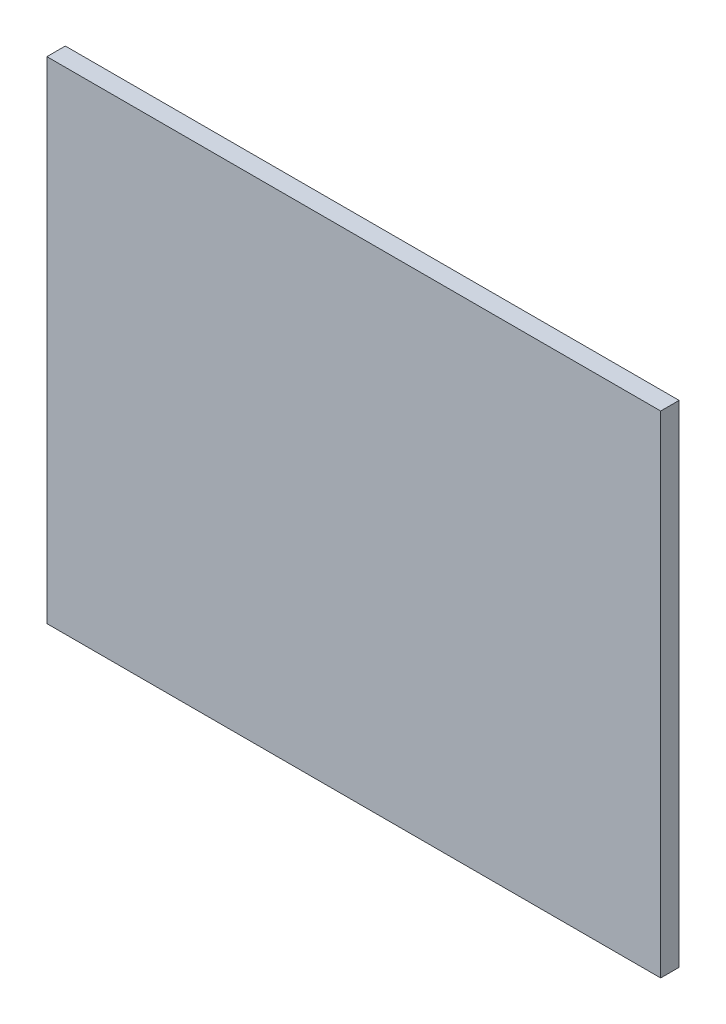
ISO-10303-21;
HEADER;
FILE_DESCRIPTION(('STEP AP214'),'2;1');
FILE_NAME('part.step','',(''),(''),'','','');
FILE_SCHEMA(('AUTOMOTIVE_DESIGN { 1 0 10303 214 1 1 1 1 }'));
ENDSEC;
DATA;
#1=APPLICATION_CONTEXT('core data for automotive mechanical design processes');
#2=APPLICATION_PROTOCOL_DEFINITION('international standard','automotive_design',2000,#1);
#3=PRODUCT_CONTEXT('',#1,'mechanical');
#4=PRODUCT('Part','Part','',(#3));
#5=PRODUCT_RELATED_PRODUCT_CATEGORY('part','',(#4));
#6=PRODUCT_DEFINITION_FORMATION('','',#4);
#7=PRODUCT_DEFINITION_CONTEXT('part definition',#1,'design');
#8=PRODUCT_DEFINITION('design','',#6,#7);
#9=PRODUCT_DEFINITION_SHAPE('','',#8);
#10=(LENGTH_UNIT() NAMED_UNIT(*) SI_UNIT(.MILLI.,.METRE.));
#11=(NAMED_UNIT(*) PLANE_ANGLE_UNIT() SI_UNIT($,.RADIAN.));
#12=(NAMED_UNIT(*) SI_UNIT($,.STERADIAN.) SOLID_ANGLE_UNIT());
#13=UNCERTAINTY_MEASURE_WITH_UNIT(LENGTH_MEASURE(1.E-05),#10,'distance_accuracy_value','');
#14=(GEOMETRIC_REPRESENTATION_CONTEXT(3) GLOBAL_UNCERTAINTY_ASSIGNED_CONTEXT((#13)) GLOBAL_UNIT_ASSIGNED_CONTEXT((#10,
#11,#12)) REPRESENTATION_CONTEXT('',''));
#15=CARTESIAN_POINT('',(0.,0.,0.));
#16=DIRECTION('',(0.,0.,1.));
#17=DIRECTION('',(1.,0.,0.));
#18=AXIS2_PLACEMENT_3D('',#15,#16,#17);
#19=CARTESIAN_POINT('',(0.,0.,3.));
#20=DIRECTION('',(1.,0.,0.));
#21=DIRECTION('',(0.,1.,0.));
#22=AXIS2_PLACEMENT_3D('',#19,#20,#21);
#23=PLANE('',#22);
#24=DIRECTION('',(0.,-1.,0.));
#25=VECTOR('',#24,1.);
#26=CARTESIAN_POINT('',(0.,0.,0.));
#27=LINE('',#26,#25);
#28=CARTESIAN_POINT('',(0.,80.,0.));
#29=VERTEX_POINT('',#28);
#30=CARTESIAN_POINT('',(0.,0.,0.));
#31=VERTEX_POINT('',#30);
#32=EDGE_CURVE('E96',#29,#31,#27,.T.);
#33=ORIENTED_EDGE('',*,*,#32,.T.);
#34=DIRECTION('',(0.,0.,-1.));
#35=VECTOR('',#34,1.);
#36=CARTESIAN_POINT('',(0.,0.,3.));
#37=LINE('',#36,#35);
#38=CARTESIAN_POINT('',(0.,0.,3.));
#39=VERTEX_POINT('',#38);
#40=EDGE_CURVE('E11',#39,#31,#37,.T.);
#41=ORIENTED_EDGE('',*,*,#40,.F.);
#42=DIRECTION('',(0.,-1.,0.));
#43=VECTOR('',#42,1.);
#44=CARTESIAN_POINT('',(0.,0.,3.));
#45=LINE('',#44,#43);
#46=CARTESIAN_POINT('',(0.,80.,3.));
#47=VERTEX_POINT('',#46);
#48=EDGE_CURVE('E84',#47,#39,#45,.T.);
#49=ORIENTED_EDGE('',*,*,#48,.F.);
#50=DIRECTION('',(0.,0.,-1.));
#51=VECTOR('',#50,1.);
#52=CARTESIAN_POINT('',(0.,80.,3.));
#53=LINE('',#52,#51);
#54=EDGE_CURVE('E92',#47,#29,#53,.T.);
#55=ORIENTED_EDGE('',*,*,#54,.T.);
#56=EDGE_LOOP('',(#33,#41,#49,#55));
#57=FACE_BOUND('',#56,.T.);
#58=ADVANCED_FACE('F33',(#57),#23,.F.);
#59=CARTESIAN_POINT('',(0.,0.,3.));
#60=DIRECTION('',(0.,1.,0.));
#61=DIRECTION('',(0.,0.,1.));
#62=AXIS2_PLACEMENT_3D('',#59,#60,#61);
#63=PLANE('',#62);
#64=DIRECTION('',(1.,0.,0.));
#65=VECTOR('',#64,1.);
#66=CARTESIAN_POINT('',(0.,0.,0.));
#67=LINE('',#66,#65);
#68=CARTESIAN_POINT('',(100.,0.,0.));
#69=VERTEX_POINT('',#68);
#70=EDGE_CURVE('E88',#31,#69,#67,.T.);
#71=ORIENTED_EDGE('',*,*,#70,.T.);
#72=DIRECTION('',(0.,0.,-1.));
#73=VECTOR('',#72,1.);
#74=CARTESIAN_POINT('',(100.,0.,3.));
#75=LINE('',#74,#73);
#76=CARTESIAN_POINT('',(100.,0.,3.));
#77=VERTEX_POINT('',#76);
#78=EDGE_CURVE('E41',#77,#69,#75,.T.);
#79=ORIENTED_EDGE('',*,*,#78,.F.);
#80=DIRECTION('',(1.,0.,0.));
#81=VECTOR('',#80,1.);
#82=CARTESIAN_POINT('',(0.,0.,3.));
#83=LINE('',#82,#81);
#84=EDGE_CURVE('E79',#39,#77,#83,.T.);
#85=ORIENTED_EDGE('',*,*,#84,.F.);
#86=ORIENTED_EDGE('',*,*,#40,.T.);
#87=EDGE_LOOP('',(#71,#79,#85,#86));
#88=FACE_BOUND('',#87,.T.);
#89=ADVANCED_FACE('F87',(#88),#63,.F.);
#90=CARTESIAN_POINT('',(100.,0.,3.));
#91=DIRECTION('',(-1.,0.,0.));
#92=DIRECTION('',(0.,0.,1.));
#93=AXIS2_PLACEMENT_3D('',#90,#91,#92);
#94=PLANE('',#93);
#95=DIRECTION('',(0.,1.,0.));
#96=VECTOR('',#95,1.);
#97=CARTESIAN_POINT('',(100.,0.,0.));
#98=LINE('',#97,#96);
#99=CARTESIAN_POINT('',(100.,80.,0.));
#100=VERTEX_POINT('',#99);
#101=EDGE_CURVE('E66',#69,#100,#98,.T.);
#102=ORIENTED_EDGE('',*,*,#101,.T.);
#103=DIRECTION('',(0.,0.,-1.));
#104=VECTOR('',#103,1.);
#105=CARTESIAN_POINT('',(100.,80.,3.));
#106=LINE('',#105,#104);
#107=CARTESIAN_POINT('',(100.,80.,3.));
#108=VERTEX_POINT('',#107);
#109=EDGE_CURVE('E89',#108,#100,#106,.T.);
#110=ORIENTED_EDGE('',*,*,#109,.F.);
#111=DIRECTION('',(0.,1.,0.));
#112=VECTOR('',#111,1.);
#113=CARTESIAN_POINT('',(100.,0.,3.));
#114=LINE('',#113,#112);
#115=EDGE_CURVE('E82',#77,#108,#114,.T.);
#116=ORIENTED_EDGE('',*,*,#115,.F.);
#117=ORIENTED_EDGE('',*,*,#78,.T.);
#118=EDGE_LOOP('',(#102,#110,#116,#117));
#119=FACE_BOUND('',#118,.T.);
#120=ADVANCED_FACE('F90',(#119),#94,.F.);
#121=CARTESIAN_POINT('',(0.,80.,3.));
#122=DIRECTION('',(0.,-1.,0.));
#123=DIRECTION('',(0.,0.,-1.));
#124=AXIS2_PLACEMENT_3D('',#121,#122,#123);
#125=PLANE('',#124);
#126=DIRECTION('',(-1.,0.,0.));
#127=VECTOR('',#126,1.);
#128=CARTESIAN_POINT('',(0.,80.,0.));
#129=LINE('',#128,#127);
#130=EDGE_CURVE('E72',#100,#29,#129,.T.);
#131=ORIENTED_EDGE('',*,*,#130,.T.);
#132=ORIENTED_EDGE('',*,*,#54,.F.);
#133=DIRECTION('',(-1.,0.,0.));
#134=VECTOR('',#133,1.);
#135=CARTESIAN_POINT('',(0.,80.,3.));
#136=LINE('',#135,#134);
#137=EDGE_CURVE('E49',#108,#47,#136,.T.);
#138=ORIENTED_EDGE('',*,*,#137,.F.);
#139=ORIENTED_EDGE('',*,*,#109,.T.);
#140=EDGE_LOOP('',(#131,#132,#138,#139));
#141=FACE_BOUND('',#140,.T.);
#142=ADVANCED_FACE('F104',(#141),#125,.F.);
#143=CARTESIAN_POINT('',(0.,0.,3.));
#144=DIRECTION('',(0.,0.,-1.));
#145=DIRECTION('',(-1.,0.,0.));
#146=AXIS2_PLACEMENT_3D('',#143,#144,#145);
#147=PLANE('',#146);
#148=ORIENTED_EDGE('',*,*,#48,.T.);
#149=ORIENTED_EDGE('',*,*,#84,.T.);
#150=ORIENTED_EDGE('',*,*,#115,.T.);
#151=ORIENTED_EDGE('',*,*,#137,.T.);
#152=EDGE_LOOP('',(#148,#149,#150,#151));
#153=FACE_BOUND('',#152,.T.);
#154=ADVANCED_FACE('F80',(#153),#147,.F.);
#155=CARTESIAN_POINT('',(0.,0.,0.));
#156=DIRECTION('',(0.,0.,-1.));
#157=DIRECTION('',(-1.,0.,0.));
#158=AXIS2_PLACEMENT_3D('',#155,#156,#157);
#159=PLANE('',#158);
#160=ORIENTED_EDGE('',*,*,#32,.F.);
#161=ORIENTED_EDGE('',*,*,#130,.F.);
#162=ORIENTED_EDGE('',*,*,#101,.F.);
#163=ORIENTED_EDGE('',*,*,#70,.F.);
#164=EDGE_LOOP('',(#160,#161,#162,#163));
#165=FACE_BOUND('',#164,.T.);
#166=ADVANCED_FACE('F107',(#165),#159,.T.);
#167=CLOSED_SHELL('',(#58,#89,#120,#142,#154,#166));
#168=CARTESIAN_POINT('',(4.00000000000001,4.,1.2));
#169=DIRECTION('',(0.,0.,1.));
#170=DIRECTION('',(1.,0.,0.));
#171=AXIS2_PLACEMENT_3D('',#168,#169,#170);
#172=CYLINDRICAL_SURFACE('',#171,3.);
#173=CARTESIAN_POINT('',(4.00000000000001,4.,1.2));
#174=DIRECTION('',(0.,0.,1.));
#175=DIRECTION('',(-1.,0.,0.));
#176=AXIS2_PLACEMENT_3D('',#173,#174,#175);
#177=CIRCLE('',#176,3.);
#178=CARTESIAN_POINT('',(1.00000000000001,4.,1.2));
#179=VERTEX_POINT('',#178);
#180=EDGE_CURVE('E119',#179,#179,#177,.T.);
#181=ORIENTED_EDGE('',*,*,#180,.F.);
#182=EDGE_LOOP('',(#181));
#183=FACE_BOUND('',#182,.T.);
#184=CARTESIAN_POINT('',(4.00000000000001,4.,2.6));
#185=DIRECTION('',(0.,0.,1.));
#186=DIRECTION('',(-1.,0.,0.));
#187=AXIS2_PLACEMENT_3D('',#184,#185,#186);
#188=CIRCLE('',#187,3.);
#189=CARTESIAN_POINT('',(1.00000000000001,4.,2.6));
#190=VERTEX_POINT('',#189);
#191=EDGE_CURVE('E116',#190,#190,#188,.T.);
#192=ORIENTED_EDGE('',*,*,#191,.T.);
#193=EDGE_LOOP('',(#192));
#194=FACE_BOUND('',#193,.T.);
#195=ADVANCED_FACE('F181',(#183,#194),#172,.F.);
#196=CARTESIAN_POINT('',(4.00000000000001,4.,1.2));
#197=DIRECTION('',(0.,0.,-1.));
#198=DIRECTION('',(-1.,0.,0.));
#199=AXIS2_PLACEMENT_3D('',#196,#197,#198);
#200=PLANE('',#199);
#201=ORIENTED_EDGE('',*,*,#180,.T.);
#202=EDGE_LOOP('',(#201));
#203=FACE_BOUND('',#202,.T.);
#204=ADVANCED_FACE('F177',(#203),#200,.F.);
#205=CARTESIAN_POINT('',(4.00000000000001,4.,2.6));
#206=DIRECTION('',(0.,0.,-1.));
#207=DIRECTION('',(-1.,0.,0.));
#208=AXIS2_PLACEMENT_3D('',#205,#206,#207);
#209=PLANE('',#208);
#210=ORIENTED_EDGE('',*,*,#191,.F.);
#211=EDGE_LOOP('',(#210));
#212=FACE_BOUND('',#211,.T.);
#213=ADVANCED_FACE('F180',(#212),#209,.T.);
#214=CLOSED_SHELL('',(#195,#204,#213));
#215=CARTESIAN_POINT('',(96.,4.00000000000003,1.2));
#216=DIRECTION('',(0.,0.,1.));
#217=DIRECTION('',(1.,0.,0.));
#218=AXIS2_PLACEMENT_3D('',#215,#216,#217);
#219=CYLINDRICAL_SURFACE('',#218,2.99999999999999);
#220=CARTESIAN_POINT('',(96.,4.00000000000003,1.2));
#221=DIRECTION('',(0.,0.,1.));
#222=DIRECTION('',(1.,0.,0.));
#223=AXIS2_PLACEMENT_3D('',#220,#221,#222);
#224=CIRCLE('',#223,2.99999999999999);
#225=CARTESIAN_POINT('',(99.,4.00000000000003,1.2));
#226=VERTEX_POINT('',#225);
#227=EDGE_CURVE('E125',#226,#226,#224,.T.);
#228=ORIENTED_EDGE('',*,*,#227,.F.);
#229=EDGE_LOOP('',(#228));
#230=FACE_BOUND('',#229,.T.);
#231=CARTESIAN_POINT('',(96.,4.00000000000003,2.6));
#232=DIRECTION('',(0.,0.,1.));
#233=DIRECTION('',(1.,0.,0.));
#234=AXIS2_PLACEMENT_3D('',#231,#232,#233);
#235=CIRCLE('',#234,2.99999999999999);
#236=CARTESIAN_POINT('',(99.,4.00000000000003,2.6));
#237=VERTEX_POINT('',#236);
#238=EDGE_CURVE('E122',#237,#237,#235,.T.);
#239=ORIENTED_EDGE('',*,*,#238,.T.);
#240=EDGE_LOOP('',(#239));
#241=FACE_BOUND('',#240,.T.);
#242=ADVANCED_FACE('F160',(#230,#241),#219,.F.);
#243=CARTESIAN_POINT('',(96.,4.00000000000003,1.2));
#244=DIRECTION('',(0.,0.,1.));
#245=DIRECTION('',(1.,0.,0.));
#246=AXIS2_PLACEMENT_3D('',#243,#244,#245);
#247=PLANE('',#246);
#248=ORIENTED_EDGE('',*,*,#227,.T.);
#249=EDGE_LOOP('',(#248));
#250=FACE_BOUND('',#249,.T.);
#251=ADVANCED_FACE('F162',(#250),#247,.T.);
#252=CARTESIAN_POINT('',(96.,4.00000000000003,2.6));
#253=DIRECTION('',(0.,0.,1.));
#254=DIRECTION('',(1.,0.,0.));
#255=AXIS2_PLACEMENT_3D('',#252,#253,#254);
#256=PLANE('',#255);
#257=ORIENTED_EDGE('',*,*,#238,.F.);
#258=EDGE_LOOP('',(#257));
#259=FACE_BOUND('',#258,.T.);
#260=ADVANCED_FACE('F170',(#259),#256,.F.);
#261=CLOSED_SHELL('',(#242,#251,#260));
#262=CARTESIAN_POINT('',(96.,76.,1.2));
#263=DIRECTION('',(0.,0.,1.));
#264=DIRECTION('',(1.,0.,0.));
#265=AXIS2_PLACEMENT_3D('',#262,#263,#264);
#266=CYLINDRICAL_SURFACE('',#265,2.99999999999999);
#267=CARTESIAN_POINT('',(96.,76.,1.2));
#268=DIRECTION('',(0.,0.,1.));
#269=DIRECTION('',(-1.,0.,0.));
#270=AXIS2_PLACEMENT_3D('',#267,#268,#269);
#271=CIRCLE('',#270,2.99999999999999);
#272=CARTESIAN_POINT('',(93.,76.,1.2));
#273=VERTEX_POINT('',#272);
#274=EDGE_CURVE('E113',#273,#273,#271,.T.);
#275=ORIENTED_EDGE('',*,*,#274,.F.);
#276=EDGE_LOOP('',(#275));
#277=FACE_BOUND('',#276,.T.);
#278=CARTESIAN_POINT('',(96.,76.,2.6));
#279=DIRECTION('',(0.,0.,1.));
#280=DIRECTION('',(-1.,0.,0.));
#281=AXIS2_PLACEMENT_3D('',#278,#279,#280);
#282=CIRCLE('',#281,2.99999999999999);
#283=CARTESIAN_POINT('',(93.,76.,2.6));
#284=VERTEX_POINT('',#283);
#285=EDGE_CURVE('E128',#284,#284,#282,.T.);
#286=ORIENTED_EDGE('',*,*,#285,.T.);
#287=EDGE_LOOP('',(#286));
#288=FACE_BOUND('',#287,.T.);
#289=ADVANCED_FACE('F136',(#277,#288),#266,.F.);
#290=CARTESIAN_POINT('',(96.,76.,1.2));
#291=DIRECTION('',(0.,0.,-1.));
#292=DIRECTION('',(-1.,0.,0.));
#293=AXIS2_PLACEMENT_3D('',#290,#291,#292);
#294=PLANE('',#293);
#295=ORIENTED_EDGE('',*,*,#274,.T.);
#296=EDGE_LOOP('',(#295));
#297=FACE_BOUND('',#296,.T.);
#298=ADVANCED_FACE('F134',(#297),#294,.F.);
#299=CARTESIAN_POINT('',(96.,76.,2.6));
#300=DIRECTION('',(0.,0.,-1.));
#301=DIRECTION('',(-1.,0.,0.));
#302=AXIS2_PLACEMENT_3D('',#299,#300,#301);
#303=PLANE('',#302);
#304=ORIENTED_EDGE('',*,*,#285,.F.);
#305=EDGE_LOOP('',(#304));
#306=FACE_BOUND('',#305,.T.);
#307=ADVANCED_FACE('F144',(#306),#303,.T.);
#308=CLOSED_SHELL('',(#289,#298,#307));
#309=CARTESIAN_POINT('',(4.00000000000001,76.,1.2));
#310=DIRECTION('',(0.,0.,1.));
#311=DIRECTION('',(1.,0.,0.));
#312=AXIS2_PLACEMENT_3D('',#309,#310,#311);
#313=CYLINDRICAL_SURFACE('',#312,3.);
#314=CARTESIAN_POINT('',(4.00000000000001,76.,1.2));
#315=DIRECTION('',(0.,0.,1.));
#316=DIRECTION('',(1.,0.,0.));
#317=AXIS2_PLACEMENT_3D('',#314,#315,#316);
#318=CIRCLE('',#317,3.);
#319=CARTESIAN_POINT('',(7.00000000000002,76.,1.2));
#320=VERTEX_POINT('',#319);
#321=EDGE_CURVE('E99',#320,#320,#318,.T.);
#322=ORIENTED_EDGE('',*,*,#321,.F.);
#323=EDGE_LOOP('',(#322));
#324=FACE_BOUND('',#323,.T.);
#325=CARTESIAN_POINT('',(4.00000000000001,76.,2.6));
#326=DIRECTION('',(0.,0.,1.));
#327=DIRECTION('',(1.,0.,0.));
#328=AXIS2_PLACEMENT_3D('',#325,#326,#327);
#329=CIRCLE('',#328,3.);
#330=CARTESIAN_POINT('',(7.00000000000002,76.,2.6));
#331=VERTEX_POINT('',#330);
#332=EDGE_CURVE('E110',#331,#331,#329,.T.);
#333=ORIENTED_EDGE('',*,*,#332,.T.);
#334=EDGE_LOOP('',(#333));
#335=FACE_BOUND('',#334,.T.);
#336=ADVANCED_FACE('F192',(#324,#335),#313,.F.);
#337=CARTESIAN_POINT('',(4.00000000000001,76.,1.2));
#338=DIRECTION('',(0.,0.,1.));
#339=DIRECTION('',(1.,0.,0.));
#340=AXIS2_PLACEMENT_3D('',#337,#338,#339);
#341=PLANE('',#340);
#342=ORIENTED_EDGE('',*,*,#321,.T.);
#343=EDGE_LOOP('',(#342));
#344=FACE_BOUND('',#343,.T.);
#345=ADVANCED_FACE('F188',(#344),#341,.T.);
#346=CARTESIAN_POINT('',(4.00000000000001,76.,2.6));
#347=DIRECTION('',(0.,0.,1.));
#348=DIRECTION('',(1.,0.,0.));
#349=AXIS2_PLACEMENT_3D('',#346,#347,#348);
#350=PLANE('',#349);
#351=ORIENTED_EDGE('',*,*,#332,.F.);
#352=EDGE_LOOP('',(#351));
#353=FACE_BOUND('',#352,.T.);
#354=ADVANCED_FACE('F191',(#353),#350,.F.);
#355=CLOSED_SHELL('',(#336,#345,#354));
#356=ORIENTED_CLOSED_SHELL('',*,#214,.T.);
#357=ORIENTED_CLOSED_SHELL('',*,#261,.T.);
#358=ORIENTED_CLOSED_SHELL('',*,#308,.T.);
#359=ORIENTED_CLOSED_SHELL('',*,#355,.T.);
#360=BREP_WITH_VOIDS('B2',#167,(#356,#357,#358,#359));
#361=ADVANCED_BREP_SHAPE_REPRESENTATION('',(#18,#360),#14);
#362=SHAPE_DEFINITION_REPRESENTATION(#9,#361);
ENDSEC;
END-ISO-10303-21;
